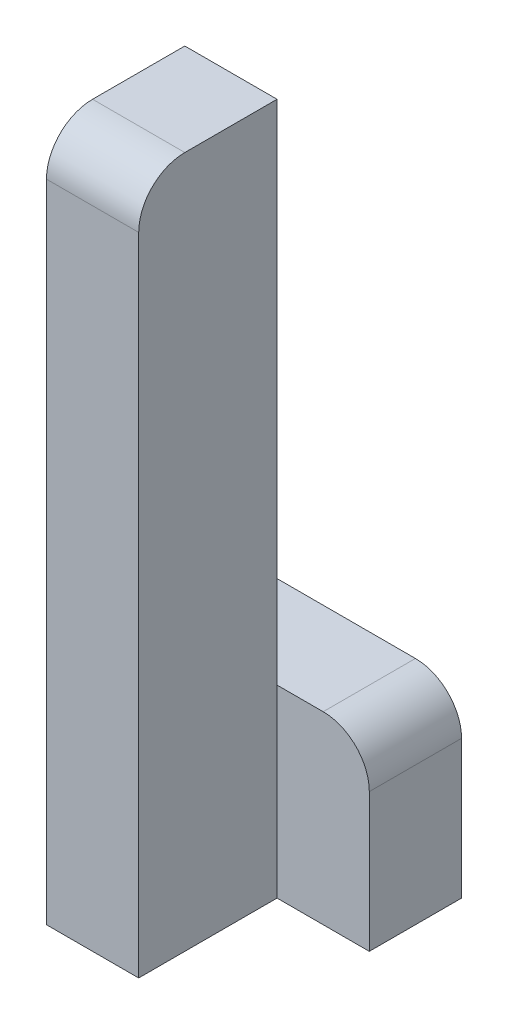
ISO-10303-21;
HEADER;
FILE_DESCRIPTION(('STEP AP214'),'2;1');
FILE_NAME('part.step','',(''),(''),'','','');
FILE_SCHEMA(('AUTOMOTIVE_DESIGN { 1 0 10303 214 1 1 1 1 }'));
ENDSEC;
DATA;
#1=APPLICATION_CONTEXT('core data for automotive mechanical design processes');
#2=APPLICATION_PROTOCOL_DEFINITION('international standard','automotive_design',2000,#1);
#3=PRODUCT_CONTEXT('',#1,'mechanical');
#4=PRODUCT('Part','Part','',(#3));
#5=PRODUCT_RELATED_PRODUCT_CATEGORY('part','',(#4));
#6=PRODUCT_DEFINITION_FORMATION('','',#4);
#7=PRODUCT_DEFINITION_CONTEXT('part definition',#1,'design');
#8=PRODUCT_DEFINITION('design','',#6,#7);
#9=PRODUCT_DEFINITION_SHAPE('','',#8);
#10=(LENGTH_UNIT() NAMED_UNIT(*) SI_UNIT(.MILLI.,.METRE.));
#11=(NAMED_UNIT(*) PLANE_ANGLE_UNIT() SI_UNIT($,.RADIAN.));
#12=(NAMED_UNIT(*) SI_UNIT($,.STERADIAN.) SOLID_ANGLE_UNIT());
#13=UNCERTAINTY_MEASURE_WITH_UNIT(LENGTH_MEASURE(1.E-05),#10,'distance_accuracy_value','');
#14=(GEOMETRIC_REPRESENTATION_CONTEXT(3) GLOBAL_UNCERTAINTY_ASSIGNED_CONTEXT((#13)) GLOBAL_UNIT_ASSIGNED_CONTEXT((#10,
#11,#12)) REPRESENTATION_CONTEXT('',''));
#15=CARTESIAN_POINT('',(0.,0.,0.));
#16=DIRECTION('',(0.,0.,1.));
#17=DIRECTION('',(1.,0.,0.));
#18=AXIS2_PLACEMENT_3D('',#15,#16,#17);
#19=CARTESIAN_POINT('',(-10.,0.,30.));
#20=DIRECTION('',(0.,-1.,0.));
#21=DIRECTION('',(1.,0.,0.));
#22=AXIS2_PLACEMENT_3D('',#19,#20,#21);
#23=PLANE('',#22);
#24=DIRECTION('',(0.,0.,-1.));
#25=VECTOR('',#24,1.);
#26=CARTESIAN_POINT('',(-30.,0.,30.));
#27=LINE('',#26,#25);
#28=CARTESIAN_POINT('',(-30.,0.,20.));
#29=VERTEX_POINT('',#28);
#30=CARTESIAN_POINT('',(-30.,0.,0.));
#31=VERTEX_POINT('',#30);
#32=EDGE_CURVE('E171',#29,#31,#27,.T.);
#33=ORIENTED_EDGE('',*,*,#32,.F.);
#34=DIRECTION('',(-1.,0.,0.));
#35=VECTOR('',#34,1.);
#36=CARTESIAN_POINT('',(-10.,0.,20.));
#37=LINE('',#36,#35);
#38=CARTESIAN_POINT('',(-10.,0.,20.));
#39=VERTEX_POINT('',#38);
#40=EDGE_CURVE('E43',#29,#39,#37,.F.);
#41=ORIENTED_EDGE('',*,*,#40,.T.);
#42=DIRECTION('',(0.,0.,-1.));
#43=VECTOR('',#42,1.);
#44=CARTESIAN_POINT('',(-10.,0.,30.));
#45=LINE('',#44,#43);
#46=CARTESIAN_POINT('',(-10.,0.,0.));
#47=VERTEX_POINT('',#46);
#48=EDGE_CURVE('E158',#39,#47,#45,.T.);
#49=ORIENTED_EDGE('',*,*,#48,.T.);
#50=DIRECTION('',(-1.,0.,0.));
#51=VECTOR('',#50,1.);
#52=CARTESIAN_POINT('',(-10.,0.,0.));
#53=LINE('',#52,#51);
#54=EDGE_CURVE('E148',#47,#31,#53,.T.);
#55=ORIENTED_EDGE('',*,*,#54,.T.);
#56=EDGE_LOOP('',(#33,#41,#49,#55));
#57=FACE_BOUND('',#56,.T.);
#58=ADVANCED_FACE('F35',(#57),#23,.F.);
#59=CARTESIAN_POINT('',(-30.,0.,30.));
#60=DIRECTION('',(1.,0.,0.));
#61=DIRECTION('',(0.,0.,-1.));
#62=AXIS2_PLACEMENT_3D('',#59,#60,#61);
#63=PLANE('',#62);
#64=DIRECTION('',(0.,-1.,0.));
#65=VECTOR('',#64,1.);
#66=CARTESIAN_POINT('',(-30.,0.,30.));
#67=LINE('',#66,#65);
#68=CARTESIAN_POINT('',(-30.,-10.,30.));
#69=VERTEX_POINT('',#68);
#70=CARTESIAN_POINT('',(-30.,-150.,30.));
#71=VERTEX_POINT('',#70);
#72=EDGE_CURVE('E150',#69,#71,#67,.T.);
#73=ORIENTED_EDGE('',*,*,#72,.F.);
#74=CARTESIAN_POINT('',(-30.,-10.,20.));
#75=DIRECTION('',(1.,0.,0.));
#76=DIRECTION('',(0.,0.,-1.));
#77=AXIS2_PLACEMENT_3D('',#74,#75,#76);
#78=CIRCLE('',#77,10.);
#79=EDGE_CURVE('E57',#69,#29,#78,.F.);
#80=ORIENTED_EDGE('',*,*,#79,.T.);
#81=ORIENTED_EDGE('',*,*,#32,.T.);
#82=DIRECTION('',(0.,-1.,0.));
#83=VECTOR('',#82,1.);
#84=CARTESIAN_POINT('',(-30.,0.,0.));
#85=LINE('',#84,#83);
#86=CARTESIAN_POINT('',(-30.,-110.,0.));
#87=VERTEX_POINT('',#86);
#88=EDGE_CURVE('E126',#31,#87,#85,.T.);
#89=ORIENTED_EDGE('',*,*,#88,.T.);
#90=DIRECTION('',(0.,0.,1.));
#91=VECTOR('',#90,1.);
#92=CARTESIAN_POINT('',(-30.,-110.,-20.));
#93=LINE('',#92,#91);
#94=CARTESIAN_POINT('',(-30.,-110.,-20.));
#95=VERTEX_POINT('',#94);
#96=EDGE_CURVE('E111',#95,#87,#93,.T.);
#97=ORIENTED_EDGE('',*,*,#96,.F.);
#98=DIRECTION('',(0.,-1.,0.));
#99=VECTOR('',#98,1.);
#100=CARTESIAN_POINT('',(-30.,-110.,-20.));
#101=LINE('',#100,#99);
#102=CARTESIAN_POINT('',(-30.,-150.,-20.));
#103=VERTEX_POINT('',#102);
#104=EDGE_CURVE('E118',#95,#103,#101,.T.);
#105=ORIENTED_EDGE('',*,*,#104,.T.);
#106=DIRECTION('',(0.,0.,-1.));
#107=VECTOR('',#106,1.);
#108=CARTESIAN_POINT('',(-30.,-150.,30.));
#109=LINE('',#108,#107);
#110=EDGE_CURVE('E169',#71,#103,#109,.T.);
#111=ORIENTED_EDGE('',*,*,#110,.F.);
#112=EDGE_LOOP('',(#73,#80,#81,#89,#97,#105,#111));
#113=FACE_BOUND('',#112,.T.);
#114=ADVANCED_FACE('F123',(#113),#63,.F.);
#115=CARTESIAN_POINT('',(-30.,-150.,30.));
#116=DIRECTION('',(0.,1.,0.));
#117=DIRECTION('',(0.,0.,1.));
#118=AXIS2_PLACEMENT_3D('',#115,#116,#117);
#119=PLANE('',#118);
#120=ORIENTED_EDGE('',*,*,#110,.T.);
#121=DIRECTION('',(1.,0.,0.));
#122=VECTOR('',#121,1.);
#123=CARTESIAN_POINT('',(-30.,-150.,-20.));
#124=LINE('',#123,#122);
#125=CARTESIAN_POINT('',(10.,-150.,-20.));
#126=VERTEX_POINT('',#125);
#127=EDGE_CURVE('E134',#103,#126,#124,.T.);
#128=ORIENTED_EDGE('',*,*,#127,.T.);
#129=DIRECTION('',(0.,0.,1.));
#130=VECTOR('',#129,1.);
#131=CARTESIAN_POINT('',(10.,-150.,-20.));
#132=LINE('',#131,#130);
#133=CARTESIAN_POINT('',(10.,-150.,0.));
#134=VERTEX_POINT('',#133);
#135=EDGE_CURVE('E127',#126,#134,#132,.T.);
#136=ORIENTED_EDGE('',*,*,#135,.T.);
#137=DIRECTION('',(1.,0.,0.));
#138=VECTOR('',#137,1.);
#139=CARTESIAN_POINT('',(-30.,-150.,0.));
#140=LINE('',#139,#138);
#141=CARTESIAN_POINT('',(-10.,-150.,0.));
#142=VERTEX_POINT('',#141);
#143=EDGE_CURVE('E142',#142,#134,#140,.T.);
#144=ORIENTED_EDGE('',*,*,#143,.F.);
#145=DIRECTION('',(0.,0.,-1.));
#146=VECTOR('',#145,1.);
#147=CARTESIAN_POINT('',(-10.,-150.,30.));
#148=LINE('',#147,#146);
#149=CARTESIAN_POINT('',(-10.,-150.,30.));
#150=VERTEX_POINT('',#149);
#151=EDGE_CURVE('E166',#150,#142,#148,.T.);
#152=ORIENTED_EDGE('',*,*,#151,.F.);
#153=DIRECTION('',(1.,0.,0.));
#154=VECTOR('',#153,1.);
#155=CARTESIAN_POINT('',(-30.,-150.,30.));
#156=LINE('',#155,#154);
#157=EDGE_CURVE('E152',#71,#150,#156,.T.);
#158=ORIENTED_EDGE('',*,*,#157,.F.);
#159=EDGE_LOOP('',(#120,#128,#136,#144,#152,#158));
#160=FACE_BOUND('',#159,.T.);
#161=ADVANCED_FACE('F193',(#160),#119,.F.);
#162=CARTESIAN_POINT('',(-10.,-150.,30.));
#163=DIRECTION('',(-1.,0.,0.));
#164=DIRECTION('',(0.,0.,1.));
#165=AXIS2_PLACEMENT_3D('',#162,#163,#164);
#166=PLANE('',#165);
#167=ORIENTED_EDGE('',*,*,#48,.F.);
#168=CARTESIAN_POINT('',(-10.,-10.,20.));
#169=DIRECTION('',(-1.,0.,0.));
#170=DIRECTION('',(0.,0.,1.));
#171=AXIS2_PLACEMENT_3D('',#168,#169,#170);
#172=CIRCLE('',#171,10.);
#173=CARTESIAN_POINT('',(-10.,-10.,30.));
#174=VERTEX_POINT('',#173);
#175=EDGE_CURVE('E11',#39,#174,#172,.F.);
#176=ORIENTED_EDGE('',*,*,#175,.T.);
#177=DIRECTION('',(0.,1.,0.));
#178=VECTOR('',#177,1.);
#179=CARTESIAN_POINT('',(-10.,-150.,30.));
#180=LINE('',#179,#178);
#181=EDGE_CURVE('E155',#150,#174,#180,.T.);
#182=ORIENTED_EDGE('',*,*,#181,.F.);
#183=ORIENTED_EDGE('',*,*,#151,.T.);
#184=DIRECTION('',(0.,1.,0.));
#185=VECTOR('',#184,1.);
#186=CARTESIAN_POINT('',(-10.,-150.,0.));
#187=LINE('',#186,#185);
#188=CARTESIAN_POINT('',(-10.,-110.,0.));
#189=VERTEX_POINT('',#188);
#190=EDGE_CURVE('E153',#142,#189,#187,.T.);
#191=ORIENTED_EDGE('',*,*,#190,.T.);
#192=EDGE_CURVE('E162',#189,#47,#187,.T.);
#193=ORIENTED_EDGE('',*,*,#192,.T.);
#194=EDGE_LOOP('',(#167,#176,#182,#183,#191,#193));
#195=FACE_BOUND('',#194,.T.);
#196=ADVANCED_FACE('F196',(#195),#166,.F.);
#197=CARTESIAN_POINT('',(0.,0.,30.));
#198=DIRECTION('',(0.,0.,1.));
#199=DIRECTION('',(1.,0.,0.));
#200=AXIS2_PLACEMENT_3D('',#197,#198,#199);
#201=PLANE('',#200);
#202=ORIENTED_EDGE('',*,*,#181,.T.);
#203=DIRECTION('',(-1.,0.,0.));
#204=VECTOR('',#203,1.);
#205=CARTESIAN_POINT('',(-30.,-10.,30.));
#206=LINE('',#205,#204);
#207=EDGE_CURVE('E181',#174,#69,#206,.T.);
#208=ORIENTED_EDGE('',*,*,#207,.T.);
#209=ORIENTED_EDGE('',*,*,#72,.T.);
#210=ORIENTED_EDGE('',*,*,#157,.T.);
#211=EDGE_LOOP('',(#202,#208,#209,#210));
#212=FACE_BOUND('',#211,.T.);
#213=ADVANCED_FACE('F186',(#212),#201,.T.);
#214=CARTESIAN_POINT('',(0.,0.,0.));
#215=DIRECTION('',(0.,0.,1.));
#216=DIRECTION('',(1.,0.,0.));
#217=AXIS2_PLACEMENT_3D('',#214,#215,#216);
#218=PLANE('',#217);
#219=ORIENTED_EDGE('',*,*,#192,.F.);
#220=DIRECTION('',(-1.,0.,0.));
#221=VECTOR('',#220,1.);
#222=CARTESIAN_POINT('',(10.,-110.,0.));
#223=LINE('',#222,#221);
#224=EDGE_CURVE('E143',#189,#87,#223,.T.);
#225=ORIENTED_EDGE('',*,*,#224,.T.);
#226=ORIENTED_EDGE('',*,*,#88,.F.);
#227=ORIENTED_EDGE('',*,*,#54,.F.);
#228=EDGE_LOOP('',(#219,#225,#226,#227));
#229=FACE_BOUND('',#228,.T.);
#230=ADVANCED_FACE('F215',(#229),#218,.F.);
#231=CARTESIAN_POINT('',(0.,0.,0.));
#232=DIRECTION('',(0.,0.,1.));
#233=DIRECTION('',(1.,0.,0.));
#234=AXIS2_PLACEMENT_3D('',#231,#232,#233);
#235=PLANE('',#234);
#236=DIRECTION('',(0.,1.,0.));
#237=VECTOR('',#236,1.);
#238=CARTESIAN_POINT('',(10.,-150.,0.));
#239=LINE('',#238,#237);
#240=CARTESIAN_POINT('',(10.,-120.,0.));
#241=VERTEX_POINT('',#240);
#242=EDGE_CURVE('E119',#134,#241,#239,.T.);
#243=ORIENTED_EDGE('',*,*,#242,.T.);
#244=CARTESIAN_POINT('',(0.,-120.,0.));
#245=DIRECTION('',(0.,0.,1.));
#246=DIRECTION('',(1.,0.,0.));
#247=AXIS2_PLACEMENT_3D('',#244,#245,#246);
#248=CIRCLE('',#247,10.);
#249=CARTESIAN_POINT('',(0.,-110.,0.));
#250=VERTEX_POINT('',#249);
#251=EDGE_CURVE('E176',#241,#250,#248,.T.);
#252=ORIENTED_EDGE('',*,*,#251,.T.);
#253=EDGE_CURVE('E140',#250,#189,#223,.T.);
#254=ORIENTED_EDGE('',*,*,#253,.T.);
#255=ORIENTED_EDGE('',*,*,#190,.F.);
#256=ORIENTED_EDGE('',*,*,#143,.T.);
#257=EDGE_LOOP('',(#243,#252,#254,#255,#256));
#258=FACE_BOUND('',#257,.T.);
#259=ADVANCED_FACE('F218',(#258),#235,.T.);
#260=CARTESIAN_POINT('',(10.,-110.,-20.));
#261=DIRECTION('',(0.,1.,0.));
#262=DIRECTION('',(0.,0.,1.));
#263=AXIS2_PLACEMENT_3D('',#260,#261,#262);
#264=PLANE('',#263);
#265=ORIENTED_EDGE('',*,*,#253,.F.);
#266=DIRECTION('',(0.,0.,1.));
#267=VECTOR('',#266,1.);
#268=CARTESIAN_POINT('',(0.,-110.,-20.));
#269=LINE('',#268,#267);
#270=CARTESIAN_POINT('',(0.,-110.,-20.));
#271=VERTEX_POINT('',#270);
#272=EDGE_CURVE('E114',#250,#271,#269,.F.);
#273=ORIENTED_EDGE('',*,*,#272,.T.);
#274=DIRECTION('',(-1.,0.,0.));
#275=VECTOR('',#274,1.);
#276=CARTESIAN_POINT('',(10.,-110.,-20.));
#277=LINE('',#276,#275);
#278=EDGE_CURVE('E106',#271,#95,#277,.T.);
#279=ORIENTED_EDGE('',*,*,#278,.T.);
#280=ORIENTED_EDGE('',*,*,#96,.T.);
#281=ORIENTED_EDGE('',*,*,#224,.F.);
#282=EDGE_LOOP('',(#265,#273,#279,#280,#281));
#283=FACE_BOUND('',#282,.T.);
#284=ADVANCED_FACE('F109',(#283),#264,.T.);
#285=CARTESIAN_POINT('',(10.,-150.,-20.));
#286=DIRECTION('',(1.,0.,0.));
#287=DIRECTION('',(0.,0.,-1.));
#288=AXIS2_PLACEMENT_3D('',#285,#286,#287);
#289=PLANE('',#288);
#290=DIRECTION('',(0.,1.,0.));
#291=VECTOR('',#290,1.);
#292=CARTESIAN_POINT('',(10.,-150.,-20.));
#293=LINE('',#292,#291);
#294=CARTESIAN_POINT('',(10.,-120.,-20.));
#295=VERTEX_POINT('',#294);
#296=EDGE_CURVE('E128',#126,#295,#293,.T.);
#297=ORIENTED_EDGE('',*,*,#296,.T.);
#298=DIRECTION('',(0.,0.,1.));
#299=VECTOR('',#298,1.);
#300=CARTESIAN_POINT('',(10.,-120.,-20.));
#301=LINE('',#300,#299);
#302=EDGE_CURVE('E173',#295,#241,#301,.T.);
#303=ORIENTED_EDGE('',*,*,#302,.T.);
#304=ORIENTED_EDGE('',*,*,#242,.F.);
#305=ORIENTED_EDGE('',*,*,#135,.F.);
#306=EDGE_LOOP('',(#297,#303,#304,#305));
#307=FACE_BOUND('',#306,.T.);
#308=ADVANCED_FACE('F224',(#307),#289,.T.);
#309=CARTESIAN_POINT('',(0.,0.,-20.));
#310=DIRECTION('',(0.,0.,1.));
#311=DIRECTION('',(1.,0.,0.));
#312=AXIS2_PLACEMENT_3D('',#309,#310,#311);
#313=PLANE('',#312);
#314=ORIENTED_EDGE('',*,*,#278,.F.);
#315=CARTESIAN_POINT('',(0.,-120.,-20.));
#316=DIRECTION('',(0.,0.,1.));
#317=DIRECTION('',(1.,0.,0.));
#318=AXIS2_PLACEMENT_3D('',#315,#316,#317);
#319=CIRCLE('',#318,10.);
#320=EDGE_CURVE('E179',#271,#295,#319,.F.);
#321=ORIENTED_EDGE('',*,*,#320,.T.);
#322=ORIENTED_EDGE('',*,*,#296,.F.);
#323=ORIENTED_EDGE('',*,*,#127,.F.);
#324=ORIENTED_EDGE('',*,*,#104,.F.);
#325=EDGE_LOOP('',(#314,#321,#322,#323,#324));
#326=FACE_BOUND('',#325,.T.);
#327=ADVANCED_FACE('F131',(#326),#313,.F.);
#328=CARTESIAN_POINT('',(0.,-120.,-20.));
#329=DIRECTION('',(0.,0.,1.));
#330=DIRECTION('',(1.,0.,0.));
#331=AXIS2_PLACEMENT_3D('',#328,#329,#330);
#332=CYLINDRICAL_SURFACE('',#331,10.);
#333=ORIENTED_EDGE('',*,*,#320,.F.);
#334=ORIENTED_EDGE('',*,*,#272,.F.);
#335=ORIENTED_EDGE('',*,*,#251,.F.);
#336=ORIENTED_EDGE('',*,*,#302,.F.);
#337=EDGE_LOOP('',(#333,#334,#335,#336));
#338=FACE_BOUND('',#337,.T.);
#339=ADVANCED_FACE('F199',(#338),#332,.T.);
#340=CARTESIAN_POINT('',(0.,-10.,20.));
#341=DIRECTION('',(1.,0.,0.));
#342=DIRECTION('',(0.,1.,0.));
#343=AXIS2_PLACEMENT_3D('',#340,#341,#342);
#344=CYLINDRICAL_SURFACE('',#343,10.);
#345=ORIENTED_EDGE('',*,*,#175,.F.);
#346=ORIENTED_EDGE('',*,*,#40,.F.);
#347=ORIENTED_EDGE('',*,*,#79,.F.);
#348=ORIENTED_EDGE('',*,*,#207,.F.);
#349=EDGE_LOOP('',(#345,#346,#347,#348));
#350=FACE_BOUND('',#349,.T.);
#351=ADVANCED_FACE('F37',(#350),#344,.T.);
#352=CLOSED_SHELL('',(#58,#114,#161,#196,#213,#230,#259,#284,#308,#327,#339,#351));
#353=MANIFOLD_SOLID_BREP('B2',#352);
#354=ADVANCED_BREP_SHAPE_REPRESENTATION('',(#18,#353),#14);
#355=SHAPE_DEFINITION_REPRESENTATION(#9,#354);
ENDSEC;
END-ISO-10303-21;
